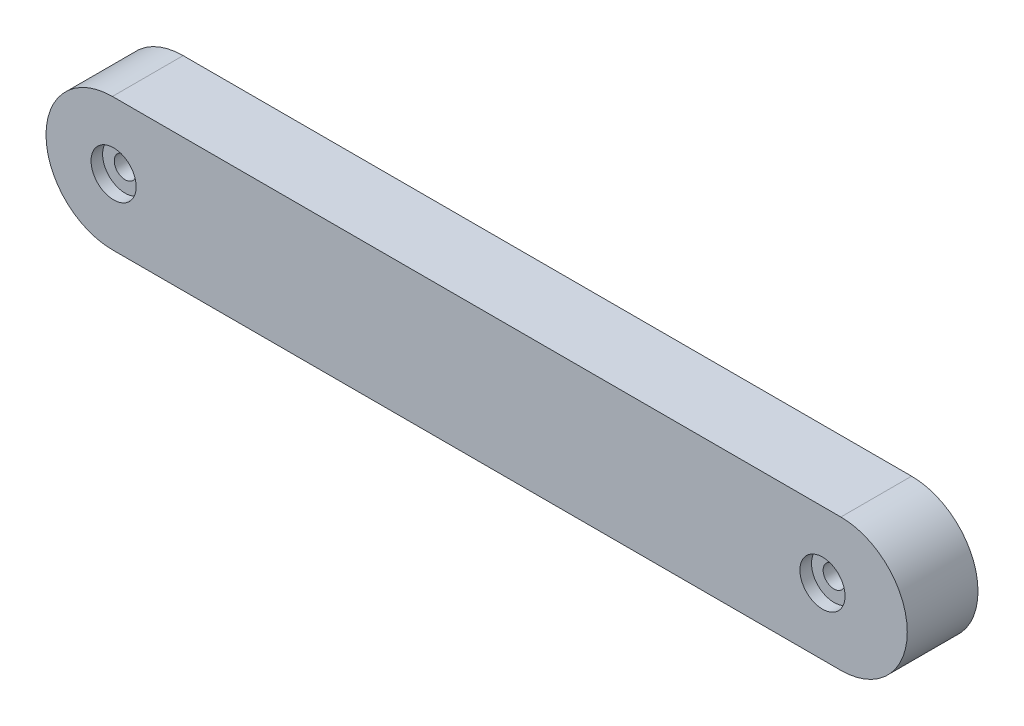
ISO-10303-21;
HEADER;
FILE_DESCRIPTION(('STEP AP214'),'2;1');
FILE_NAME('part.step','',(''),(''),'','','');
FILE_SCHEMA(('AUTOMOTIVE_DESIGN { 1 0 10303 214 1 1 1 1 }'));
ENDSEC;
DATA;
#1=APPLICATION_CONTEXT('core data for automotive mechanical design processes');
#2=APPLICATION_PROTOCOL_DEFINITION('international standard','automotive_design',2000,#1);
#3=PRODUCT_CONTEXT('',#1,'mechanical');
#4=PRODUCT('Part','Part','',(#3));
#5=PRODUCT_RELATED_PRODUCT_CATEGORY('part','',(#4));
#6=PRODUCT_DEFINITION_FORMATION('','',#4);
#7=PRODUCT_DEFINITION_CONTEXT('part definition',#1,'design');
#8=PRODUCT_DEFINITION('design','',#6,#7);
#9=PRODUCT_DEFINITION_SHAPE('','',#8);
#10=(LENGTH_UNIT() NAMED_UNIT(*) SI_UNIT(.MILLI.,.METRE.));
#11=(NAMED_UNIT(*) PLANE_ANGLE_UNIT() SI_UNIT($,.RADIAN.));
#12=(NAMED_UNIT(*) SI_UNIT($,.STERADIAN.) SOLID_ANGLE_UNIT());
#13=UNCERTAINTY_MEASURE_WITH_UNIT(LENGTH_MEASURE(1.E-05),#10,'distance_accuracy_value','');
#14=(GEOMETRIC_REPRESENTATION_CONTEXT(3) GLOBAL_UNCERTAINTY_ASSIGNED_CONTEXT((#13)) GLOBAL_UNIT_ASSIGNED_CONTEXT((#10,
#11,#12)) REPRESENTATION_CONTEXT('',''));
#15=CARTESIAN_POINT('',(0.,0.,0.));
#16=DIRECTION('',(0.,0.,1.));
#17=DIRECTION('',(1.,0.,0.));
#18=AXIS2_PLACEMENT_3D('',#15,#16,#17);
#19=CARTESIAN_POINT('',(0.,0.,10.5687124751906));
#20=DIRECTION('',(0.,0.,-1.));
#21=DIRECTION('',(-1.,0.,0.));
#22=AXIS2_PLACEMENT_3D('',#19,#20,#21);
#23=CYLINDRICAL_SURFACE('',#22,9.92635900660288);
#24=CARTESIAN_POINT('',(0.,0.,0.));
#25=DIRECTION('',(0.,0.,1.));
#26=DIRECTION('',(1.,0.,0.));
#27=AXIS2_PLACEMENT_3D('',#24,#25,#26);
#28=CIRCLE('',#27,9.92635900660288);
#29=CARTESIAN_POINT('',(0.,-9.92635900660288,0.));
#30=VERTEX_POINT('',#29);
#31=CARTESIAN_POINT('',(0.,9.92635900660288,0.));
#32=VERTEX_POINT('',#31);
#33=EDGE_CURVE('E107',#30,#32,#28,.T.);
#34=ORIENTED_EDGE('',*,*,#33,.T.);
#35=DIRECTION('',(0.,0.,-1.));
#36=VECTOR('',#35,1.);
#37=CARTESIAN_POINT('',(0.,9.92635900660288,10.5687124751906));
#38=LINE('',#37,#36);
#39=CARTESIAN_POINT('',(0.,9.92635900660288,10.5687124751906));
#40=VERTEX_POINT('',#39);
#41=EDGE_CURVE('E11',#40,#32,#38,.T.);
#42=ORIENTED_EDGE('',*,*,#41,.F.);
#43=CARTESIAN_POINT('',(0.,0.,10.5687124751906));
#44=DIRECTION('',(0.,0.,1.));
#45=DIRECTION('',(1.,0.,0.));
#46=AXIS2_PLACEMENT_3D('',#43,#44,#45);
#47=CIRCLE('',#46,9.92635900660288);
#48=CARTESIAN_POINT('',(0.,-9.92635900660288,10.5687124751906));
#49=VERTEX_POINT('',#48);
#50=EDGE_CURVE('E91',#49,#40,#47,.T.);
#51=ORIENTED_EDGE('',*,*,#50,.F.);
#52=DIRECTION('',(0.,0.,-1.));
#53=VECTOR('',#52,1.);
#54=CARTESIAN_POINT('',(0.,-9.92635900660288,10.5687124751906));
#55=LINE('',#54,#53);
#56=EDGE_CURVE('E103',#49,#30,#55,.T.);
#57=ORIENTED_EDGE('',*,*,#56,.T.);
#58=EDGE_LOOP('',(#34,#42,#51,#57));
#59=FACE_BOUND('',#58,.T.);
#60=ADVANCED_FACE('F39',(#59),#23,.T.);
#61=CARTESIAN_POINT('',(0.,9.92635900660288,10.5687124751906));
#62=DIRECTION('',(0.,-1.,0.));
#63=DIRECTION('',(1.,0.,0.));
#64=AXIS2_PLACEMENT_3D('',#61,#62,#63);
#65=PLANE('',#64);
#66=DIRECTION('',(-1.,0.,0.));
#67=VECTOR('',#66,1.);
#68=CARTESIAN_POINT('',(0.,9.92635900660288,0.));
#69=LINE('',#68,#67);
#70=CARTESIAN_POINT('',(-108.863033935049,9.92635900660287,0.));
#71=VERTEX_POINT('',#70);
#72=EDGE_CURVE('E96',#32,#71,#69,.T.);
#73=ORIENTED_EDGE('',*,*,#72,.T.);
#74=DIRECTION('',(0.,0.,-1.));
#75=VECTOR('',#74,1.);
#76=CARTESIAN_POINT('',(-108.863033935049,9.92635900660287,10.5687124751906));
#77=LINE('',#76,#75);
#78=CARTESIAN_POINT('',(-108.863033935049,9.92635900660287,10.5687124751906));
#79=VERTEX_POINT('',#78);
#80=EDGE_CURVE('E48',#79,#71,#77,.T.);
#81=ORIENTED_EDGE('',*,*,#80,.F.);
#82=DIRECTION('',(-1.,0.,0.));
#83=VECTOR('',#82,1.);
#84=CARTESIAN_POINT('',(0.,9.92635900660288,10.5687124751906));
#85=LINE('',#84,#83);
#86=EDGE_CURVE('E86',#40,#79,#85,.T.);
#87=ORIENTED_EDGE('',*,*,#86,.F.);
#88=ORIENTED_EDGE('',*,*,#41,.T.);
#89=EDGE_LOOP('',(#73,#81,#87,#88));
#90=FACE_BOUND('',#89,.T.);
#91=ADVANCED_FACE('F95',(#90),#65,.F.);
#92=CARTESIAN_POINT('',(-108.863033935049,0.,10.5687124751906));
#93=DIRECTION('',(0.,0.,-1.));
#94=DIRECTION('',(-1.,0.,0.));
#95=AXIS2_PLACEMENT_3D('',#92,#93,#94);
#96=CYLINDRICAL_SURFACE('',#95,9.92635900660288);
#97=CARTESIAN_POINT('',(-108.863033935049,0.,0.));
#98=DIRECTION('',(0.,0.,1.));
#99=DIRECTION('',(1.,0.,0.));
#100=AXIS2_PLACEMENT_3D('',#97,#98,#99);
#101=CIRCLE('',#100,9.92635900660288);
#102=CARTESIAN_POINT('',(-108.863033935049,-9.92635900660289,0.));
#103=VERTEX_POINT('',#102);
#104=EDGE_CURVE('E73',#71,#103,#101,.T.);
#105=ORIENTED_EDGE('',*,*,#104,.T.);
#106=DIRECTION('',(0.,0.,-1.));
#107=VECTOR('',#106,1.);
#108=CARTESIAN_POINT('',(-108.863033935049,-9.92635900660289,10.5687124751906));
#109=LINE('',#108,#107);
#110=CARTESIAN_POINT('',(-108.863033935049,-9.92635900660289,10.5687124751906));
#111=VERTEX_POINT('',#110);
#112=EDGE_CURVE('E98',#111,#103,#109,.T.);
#113=ORIENTED_EDGE('',*,*,#112,.F.);
#114=CARTESIAN_POINT('',(-108.863033935049,0.,10.5687124751906));
#115=DIRECTION('',(0.,0.,1.));
#116=DIRECTION('',(1.,0.,0.));
#117=AXIS2_PLACEMENT_3D('',#114,#115,#116);
#118=CIRCLE('',#117,9.92635900660288);
#119=EDGE_CURVE('E89',#79,#111,#118,.T.);
#120=ORIENTED_EDGE('',*,*,#119,.F.);
#121=ORIENTED_EDGE('',*,*,#80,.T.);
#122=EDGE_LOOP('',(#105,#113,#120,#121));
#123=FACE_BOUND('',#122,.T.);
#124=ADVANCED_FACE('F99',(#123),#96,.T.);
#125=CARTESIAN_POINT('',(0.,-9.92635900660288,10.5687124751906));
#126=DIRECTION('',(0.,1.,0.));
#127=DIRECTION('',(-1.,0.,0.));
#128=AXIS2_PLACEMENT_3D('',#125,#126,#127);
#129=PLANE('',#128);
#130=DIRECTION('',(1.,0.,0.));
#131=VECTOR('',#130,1.);
#132=CARTESIAN_POINT('',(0.,-9.92635900660288,0.));
#133=LINE('',#132,#131);
#134=EDGE_CURVE('E79',#103,#30,#133,.T.);
#135=ORIENTED_EDGE('',*,*,#134,.T.);
#136=ORIENTED_EDGE('',*,*,#56,.F.);
#137=DIRECTION('',(1.,0.,0.));
#138=VECTOR('',#137,1.);
#139=CARTESIAN_POINT('',(0.,-9.92635900660288,10.5687124751906));
#140=LINE('',#139,#138);
#141=EDGE_CURVE('E56',#111,#49,#140,.T.);
#142=ORIENTED_EDGE('',*,*,#141,.F.);
#143=ORIENTED_EDGE('',*,*,#112,.T.);
#144=EDGE_LOOP('',(#135,#136,#142,#143));
#145=FACE_BOUND('',#144,.T.);
#146=ADVANCED_FACE('F121',(#145),#129,.F.);
#147=CARTESIAN_POINT('',(0.,0.,10.5687124751906));
#148=DIRECTION('',(0.,0.,1.));
#149=DIRECTION('',(1.,0.,0.));
#150=AXIS2_PLACEMENT_3D('',#147,#148,#149);
#151=PLANE('',#150);
#152=CARTESIAN_POINT('',(-108.687959281908,0.,10.5687124751906));
#153=DIRECTION('',(0.,0.,1.));
#154=DIRECTION('',(1.,0.,0.));
#155=AXIS2_PLACEMENT_3D('',#152,#153,#154);
#156=CIRCLE('',#155,3.37311999999999);
#157=CARTESIAN_POINT('',(-105.314839281908,0.,10.5687124751906));
#158=VERTEX_POINT('',#157);
#159=EDGE_CURVE('E155',#158,#158,#156,.T.);
#160=ORIENTED_EDGE('',*,*,#159,.F.);
#161=EDGE_LOOP('',(#160));
#162=FACE_BOUND('',#161,.T.);
#163=CARTESIAN_POINT('',(-2.74432122513107,0.,10.5687124751906));
#164=DIRECTION('',(0.,0.,1.));
#165=DIRECTION('',(1.,0.,0.));
#166=AXIS2_PLACEMENT_3D('',#163,#164,#165);
#167=CIRCLE('',#166,3.37312);
#168=CARTESIAN_POINT('',(0.628798774868926,0.,10.5687124751906));
#169=VERTEX_POINT('',#168);
#170=EDGE_CURVE('E139',#169,#169,#167,.T.);
#171=ORIENTED_EDGE('',*,*,#170,.F.);
#172=EDGE_LOOP('',(#171));
#173=FACE_BOUND('',#172,.T.);
#174=ORIENTED_EDGE('',*,*,#50,.T.);
#175=ORIENTED_EDGE('',*,*,#86,.T.);
#176=ORIENTED_EDGE('',*,*,#119,.T.);
#177=ORIENTED_EDGE('',*,*,#141,.T.);
#178=EDGE_LOOP('',(#174,#175,#176,#177));
#179=FACE_BOUND('',#178,.T.);
#180=ADVANCED_FACE('F87',(#162,#173,#179),#151,.T.);
#181=CARTESIAN_POINT('',(0.,0.,0.));
#182=DIRECTION('',(0.,0.,1.));
#183=DIRECTION('',(1.,0.,0.));
#184=AXIS2_PLACEMENT_3D('',#181,#182,#183);
#185=PLANE('',#184);
#186=CARTESIAN_POINT('',(-108.687959281908,0.,0.));
#187=DIRECTION('',(0.,0.,1.));
#188=DIRECTION('',(1.,0.,0.));
#189=AXIS2_PLACEMENT_3D('',#186,#187,#188);
#190=CIRCLE('',#189,1.63194999999999);
#191=CARTESIAN_POINT('',(-107.056009281908,0.,0.));
#192=VERTEX_POINT('',#191);
#193=EDGE_CURVE('E143',#192,#192,#190,.T.);
#194=ORIENTED_EDGE('',*,*,#193,.T.);
#195=EDGE_LOOP('',(#194));
#196=FACE_BOUND('',#195,.T.);
#197=CARTESIAN_POINT('',(-2.74432122513107,0.,0.));
#198=DIRECTION('',(0.,0.,1.));
#199=DIRECTION('',(1.,0.,0.));
#200=AXIS2_PLACEMENT_3D('',#197,#198,#199);
#201=CIRCLE('',#200,1.63195);
#202=CARTESIAN_POINT('',(-1.11237122513108,0.,0.));
#203=VERTEX_POINT('',#202);
#204=EDGE_CURVE('E111',#203,#203,#201,.T.);
#205=ORIENTED_EDGE('',*,*,#204,.T.);
#206=EDGE_LOOP('',(#205));
#207=FACE_BOUND('',#206,.T.);
#208=ORIENTED_EDGE('',*,*,#33,.F.);
#209=ORIENTED_EDGE('',*,*,#134,.F.);
#210=ORIENTED_EDGE('',*,*,#104,.F.);
#211=ORIENTED_EDGE('',*,*,#72,.F.);
#212=EDGE_LOOP('',(#208,#209,#210,#211));
#213=FACE_BOUND('',#212,.T.);
#214=ADVANCED_FACE('F124',(#196,#207,#213),#185,.F.);
#215=CARTESIAN_POINT('',(-2.74432122513107,0.,10.5687124751906));
#216=DIRECTION('',(0.,0.,1.));
#217=DIRECTION('',(1.,0.,0.));
#218=AXIS2_PLACEMENT_3D('',#215,#216,#217);
#219=CYLINDRICAL_SURFACE('',#218,1.63195);
#220=ORIENTED_EDGE('',*,*,#204,.F.);
#221=EDGE_LOOP('',(#220));
#222=FACE_BOUND('',#221,.T.);
#223=CARTESIAN_POINT('',(-2.74432122513107,0.,8.84151247519062));
#224=DIRECTION('',(0.,0.,1.));
#225=DIRECTION('',(1.,0.,0.));
#226=AXIS2_PLACEMENT_3D('',#223,#224,#225);
#227=CIRCLE('',#226,1.63195);
#228=CARTESIAN_POINT('',(-1.11237122513107,0.,8.84151247519062));
#229=VERTEX_POINT('',#228);
#230=EDGE_CURVE('E131',#229,#229,#227,.T.);
#231=ORIENTED_EDGE('',*,*,#230,.T.);
#232=EDGE_LOOP('',(#231));
#233=FACE_BOUND('',#232,.T.);
#234=ADVANCED_FACE('F180',(#222,#233),#219,.F.);
#235=CARTESIAN_POINT('',(-1.11237122513107,0.,8.84151247519062));
#236=DIRECTION('',(0.,0.,-1.));
#237=DIRECTION('',(-1.,0.,0.));
#238=AXIS2_PLACEMENT_3D('',#235,#236,#237);
#239=PLANE('',#238);
#240=ORIENTED_EDGE('',*,*,#230,.F.);
#241=EDGE_LOOP('',(#240));
#242=FACE_BOUND('',#241,.T.);
#243=CARTESIAN_POINT('',(-2.74432122513107,0.,8.84151247519062));
#244=DIRECTION('',(0.,0.,1.));
#245=DIRECTION('',(1.,0.,0.));
#246=AXIS2_PLACEMENT_3D('',#243,#244,#245);
#247=CIRCLE('',#246,3.37312);
#248=CARTESIAN_POINT('',(0.628798774868925,0.,8.84151247519062));
#249=VERTEX_POINT('',#248);
#250=EDGE_CURVE('E135',#249,#249,#247,.T.);
#251=ORIENTED_EDGE('',*,*,#250,.T.);
#252=EDGE_LOOP('',(#251));
#253=FACE_BOUND('',#252,.T.);
#254=ADVANCED_FACE('F170',(#242,#253),#239,.F.);
#255=CARTESIAN_POINT('',(-2.74432122513107,0.,10.5687124751906));
#256=DIRECTION('',(0.,0.,1.));
#257=DIRECTION('',(1.,0.,0.));
#258=AXIS2_PLACEMENT_3D('',#255,#256,#257);
#259=CYLINDRICAL_SURFACE('',#258,3.37312);
#260=ORIENTED_EDGE('',*,*,#250,.F.);
#261=EDGE_LOOP('',(#260));
#262=FACE_BOUND('',#261,.T.);
#263=ORIENTED_EDGE('',*,*,#170,.T.);
#264=EDGE_LOOP('',(#263));
#265=FACE_BOUND('',#264,.T.);
#266=ADVANCED_FACE('F167',(#262,#265),#259,.F.);
#267=CARTESIAN_POINT('',(-108.687959281908,0.,10.5687124751906));
#268=DIRECTION('',(0.,0.,1.));
#269=DIRECTION('',(1.,0.,0.));
#270=AXIS2_PLACEMENT_3D('',#267,#268,#269);
#271=CYLINDRICAL_SURFACE('',#270,1.63195);
#272=ORIENTED_EDGE('',*,*,#193,.F.);
#273=EDGE_LOOP('',(#272));
#274=FACE_BOUND('',#273,.T.);
#275=CARTESIAN_POINT('',(-108.687959281908,0.,8.84151247519062));
#276=DIRECTION('',(0.,0.,1.));
#277=DIRECTION('',(1.,0.,0.));
#278=AXIS2_PLACEMENT_3D('',#275,#276,#277);
#279=CIRCLE('',#278,1.63195000000001);
#280=CARTESIAN_POINT('',(-107.056009281908,0.,8.84151247519062));
#281=VERTEX_POINT('',#280);
#282=EDGE_CURVE('E147',#281,#281,#279,.T.);
#283=ORIENTED_EDGE('',*,*,#282,.T.);
#284=EDGE_LOOP('',(#283));
#285=FACE_BOUND('',#284,.T.);
#286=ADVANCED_FACE('F169',(#274,#285),#271,.F.);
#287=CARTESIAN_POINT('',(-107.056009281908,0.,8.84151247519062));
#288=DIRECTION('',(0.,0.,-1.));
#289=DIRECTION('',(-1.,0.,0.));
#290=AXIS2_PLACEMENT_3D('',#287,#288,#289);
#291=PLANE('',#290);
#292=ORIENTED_EDGE('',*,*,#282,.F.);
#293=EDGE_LOOP('',(#292));
#294=FACE_BOUND('',#293,.T.);
#295=CARTESIAN_POINT('',(-108.687959281908,0.,8.84151247519062));
#296=DIRECTION('',(0.,0.,1.));
#297=DIRECTION('',(1.,0.,0.));
#298=AXIS2_PLACEMENT_3D('',#295,#296,#297);
#299=CIRCLE('',#298,3.37311999999999);
#300=CARTESIAN_POINT('',(-105.314839281908,0.,8.84151247519062));
#301=VERTEX_POINT('',#300);
#302=EDGE_CURVE('E151',#301,#301,#299,.T.);
#303=ORIENTED_EDGE('',*,*,#302,.T.);
#304=EDGE_LOOP('',(#303));
#305=FACE_BOUND('',#304,.T.);
#306=ADVANCED_FACE('F177',(#294,#305),#291,.F.);
#307=CARTESIAN_POINT('',(-108.687959281908,0.,10.5687124751906));
#308=DIRECTION('',(0.,0.,1.));
#309=DIRECTION('',(1.,0.,0.));
#310=AXIS2_PLACEMENT_3D('',#307,#308,#309);
#311=CYLINDRICAL_SURFACE('',#310,3.37311999999999);
#312=ORIENTED_EDGE('',*,*,#302,.F.);
#313=EDGE_LOOP('',(#312));
#314=FACE_BOUND('',#313,.T.);
#315=ORIENTED_EDGE('',*,*,#159,.T.);
#316=EDGE_LOOP('',(#315));
#317=FACE_BOUND('',#316,.T.);
#318=ADVANCED_FACE('F160',(#314,#317),#311,.F.);
#319=CLOSED_SHELL('',(#60,#91,#124,#146,#180,#214,#234,#254,#266,#286,#306,#318));
#320=MANIFOLD_SOLID_BREP('B2',#319);
#321=ADVANCED_BREP_SHAPE_REPRESENTATION('',(#18,#320),#14);
#322=SHAPE_DEFINITION_REPRESENTATION(#9,#321);
ENDSEC;
END-ISO-10303-21;
